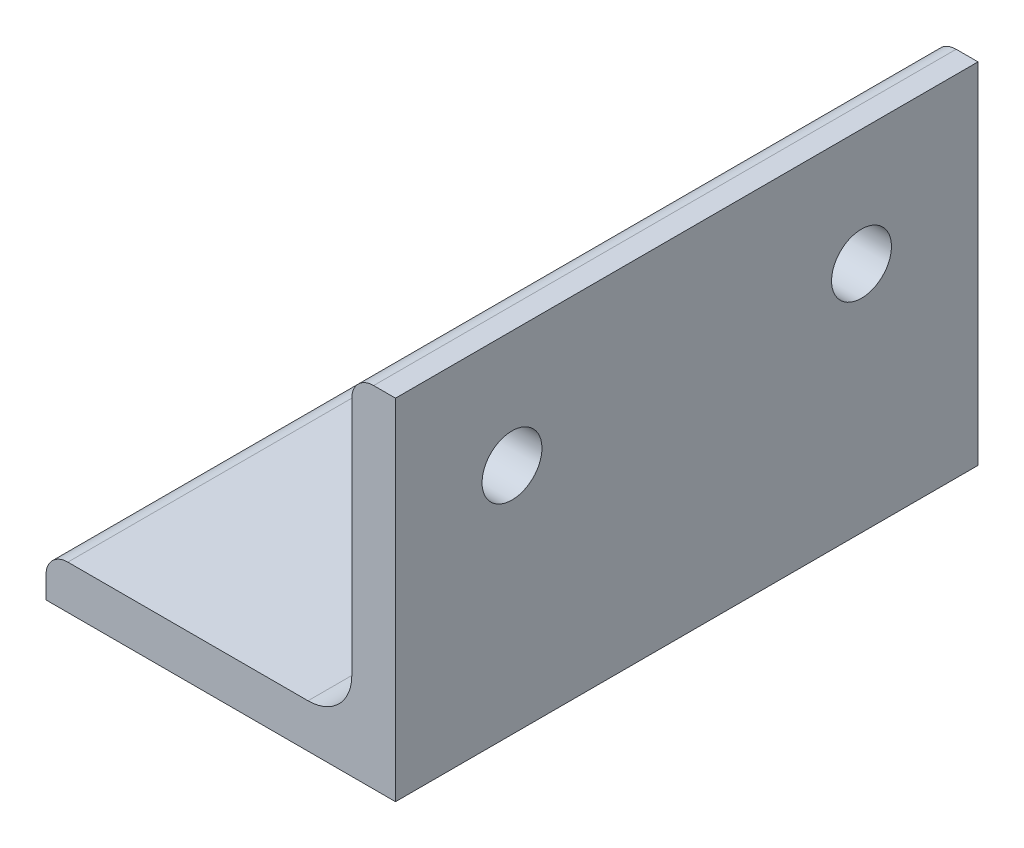
ISO-10303-21;
HEADER;
FILE_DESCRIPTION(('STEP AP214'),'2;1');
FILE_NAME('part.step','',(''),(''),'','','');
FILE_SCHEMA(('AUTOMOTIVE_DESIGN { 1 0 10303 214 1 1 1 1 }'));
ENDSEC;
DATA;
#1=APPLICATION_CONTEXT('core data for automotive mechanical design processes');
#2=APPLICATION_PROTOCOL_DEFINITION('international standard','automotive_design',2000,#1);
#3=PRODUCT_CONTEXT('',#1,'mechanical');
#4=PRODUCT('Part','Part','',(#3));
#5=PRODUCT_RELATED_PRODUCT_CATEGORY('part','',(#4));
#6=PRODUCT_DEFINITION_FORMATION('','',#4);
#7=PRODUCT_DEFINITION_CONTEXT('part definition',#1,'design');
#8=PRODUCT_DEFINITION('design','',#6,#7);
#9=PRODUCT_DEFINITION_SHAPE('','',#8);
#10=(LENGTH_UNIT() NAMED_UNIT(*) SI_UNIT(.MILLI.,.METRE.));
#11=(NAMED_UNIT(*) PLANE_ANGLE_UNIT() SI_UNIT($,.RADIAN.));
#12=(NAMED_UNIT(*) SI_UNIT($,.STERADIAN.) SOLID_ANGLE_UNIT());
#13=UNCERTAINTY_MEASURE_WITH_UNIT(LENGTH_MEASURE(1.E-05),#10,'distance_accuracy_value','');
#14=(GEOMETRIC_REPRESENTATION_CONTEXT(3) GLOBAL_UNCERTAINTY_ASSIGNED_CONTEXT((#13)) GLOBAL_UNIT_ASSIGNED_CONTEXT((#10,
#11,#12)) REPRESENTATION_CONTEXT('',''));
#15=CARTESIAN_POINT('',(0.,0.,0.));
#16=DIRECTION('',(0.,0.,1.));
#17=DIRECTION('',(1.,0.,0.));
#18=AXIS2_PLACEMENT_3D('',#15,#16,#17);
#19=CARTESIAN_POINT('',(-19.05,-16.66875,31.75));
#20=DIRECTION('',(1.,0.,0.));
#21=DIRECTION('',(0.,0.,-1.));
#22=AXIS2_PLACEMENT_3D('',#19,#20,#21);
#23=PLANE('',#22);
#24=DIRECTION('',(0.,-1.,0.));
#25=VECTOR('',#24,1.);
#26=CARTESIAN_POINT('',(-19.05,-16.66875,-31.75));
#27=LINE('',#26,#25);
#28=CARTESIAN_POINT('',(-19.05,-16.66875,-31.75));
#29=VERTEX_POINT('',#28);
#30=CARTESIAN_POINT('',(-19.05,-19.05,-31.75));
#31=VERTEX_POINT('',#30);
#32=EDGE_CURVE('E135',#29,#31,#27,.T.);
#33=ORIENTED_EDGE('',*,*,#32,.T.);
#34=DIRECTION('',(0.,0.,-1.));
#35=VECTOR('',#34,1.);
#36=CARTESIAN_POINT('',(-19.05,-19.05,31.75));
#37=LINE('',#36,#35);
#38=CARTESIAN_POINT('',(-19.05,-19.05,31.75));
#39=VERTEX_POINT('',#38);
#40=EDGE_CURVE('E11',#39,#31,#37,.T.);
#41=ORIENTED_EDGE('',*,*,#40,.F.);
#42=DIRECTION('',(0.,-1.,0.));
#43=VECTOR('',#42,1.);
#44=CARTESIAN_POINT('',(-19.05,-16.66875,31.75));
#45=LINE('',#44,#43);
#46=CARTESIAN_POINT('',(-19.05,-16.66875,31.75));
#47=VERTEX_POINT('',#46);
#48=EDGE_CURVE('E152',#47,#39,#45,.T.);
#49=ORIENTED_EDGE('',*,*,#48,.F.);
#50=DIRECTION('',(0.,0.,-1.));
#51=VECTOR('',#50,1.);
#52=CARTESIAN_POINT('',(-19.05,-16.66875,31.75));
#53=LINE('',#52,#51);
#54=EDGE_CURVE('E131',#47,#29,#53,.T.);
#55=ORIENTED_EDGE('',*,*,#54,.T.);
#56=EDGE_LOOP('',(#33,#41,#49,#55));
#57=FACE_BOUND('',#56,.T.);
#58=ADVANCED_FACE('F33',(#57),#23,.F.);
#59=CARTESIAN_POINT('',(-19.05,-19.05,31.75));
#60=DIRECTION('',(0.,1.,0.));
#61=DIRECTION('',(-1.,0.,0.));
#62=AXIS2_PLACEMENT_3D('',#59,#60,#61);
#63=PLANE('',#62);
#64=DIRECTION('',(1.,0.,0.));
#65=VECTOR('',#64,1.);
#66=CARTESIAN_POINT('',(-19.05,-19.05,-31.75));
#67=LINE('',#66,#65);
#68=CARTESIAN_POINT('',(19.05,-19.05,-31.75));
#69=VERTEX_POINT('',#68);
#70=EDGE_CURVE('E138',#31,#69,#67,.T.);
#71=ORIENTED_EDGE('',*,*,#70,.T.);
#72=DIRECTION('',(0.,0.,-1.));
#73=VECTOR('',#72,1.);
#74=CARTESIAN_POINT('',(19.05,-19.05,31.75));
#75=LINE('',#74,#73);
#76=CARTESIAN_POINT('',(19.05,-19.05,31.75));
#77=VERTEX_POINT('',#76);
#78=EDGE_CURVE('E41',#77,#69,#75,.T.);
#79=ORIENTED_EDGE('',*,*,#78,.F.);
#80=DIRECTION('',(1.,0.,0.));
#81=VECTOR('',#80,1.);
#82=CARTESIAN_POINT('',(-19.05,-19.05,31.75));
#83=LINE('',#82,#81);
#84=EDGE_CURVE('E95',#39,#77,#83,.T.);
#85=ORIENTED_EDGE('',*,*,#84,.F.);
#86=ORIENTED_EDGE('',*,*,#40,.T.);
#87=EDGE_LOOP('',(#71,#79,#85,#86));
#88=FACE_BOUND('',#87,.T.);
#89=ADVANCED_FACE('F228',(#88),#63,.F.);
#90=CARTESIAN_POINT('',(19.05,-19.05,31.75));
#91=DIRECTION('',(-1.,0.,0.));
#92=DIRECTION('',(0.,-1.,0.));
#93=AXIS2_PLACEMENT_3D('',#90,#91,#92);
#94=PLANE('',#93);
#95=CARTESIAN_POINT('',(19.05,6.34999999999988,-19.0500000000013));
#96=DIRECTION('',(-1.,0.,0.));
#97=DIRECTION('',(0.,-1.,0.));
#98=AXIS2_PLACEMENT_3D('',#95,#96,#97);
#99=CIRCLE('',#98,3.2639);
#100=CARTESIAN_POINT('',(19.05,3.08609999999987,-19.0500000000013));
#101=VERTEX_POINT('',#100);
#102=EDGE_CURVE('E139',#101,#101,#99,.F.);
#103=ORIENTED_EDGE('',*,*,#102,.F.);
#104=EDGE_LOOP('',(#103));
#105=FACE_BOUND('',#104,.T.);
#106=CARTESIAN_POINT('',(19.05,6.35000000000014,19.0499999999987));
#107=DIRECTION('',(-1.,0.,0.));
#108=DIRECTION('',(0.,-1.,0.));
#109=AXIS2_PLACEMENT_3D('',#106,#107,#108);
#110=CIRCLE('',#109,3.2639);
#111=CARTESIAN_POINT('',(19.05,3.08610000000014,19.0499999999987));
#112=VERTEX_POINT('',#111);
#113=EDGE_CURVE('E193',#112,#112,#110,.F.);
#114=ORIENTED_EDGE('',*,*,#113,.F.);
#115=EDGE_LOOP('',(#114));
#116=FACE_BOUND('',#115,.T.);
#117=DIRECTION('',(0.,1.,0.));
#118=VECTOR('',#117,1.);
#119=CARTESIAN_POINT('',(19.05,-19.05,-31.75));
#120=LINE('',#119,#118);
#121=CARTESIAN_POINT('',(19.05,19.05,-31.75));
#122=VERTEX_POINT('',#121);
#123=EDGE_CURVE('E141',#69,#122,#120,.T.);
#124=ORIENTED_EDGE('',*,*,#123,.T.);
#125=DIRECTION('',(0.,0.,-1.));
#126=VECTOR('',#125,1.);
#127=CARTESIAN_POINT('',(19.05,19.05,31.75));
#128=LINE('',#127,#126);
#129=CARTESIAN_POINT('',(19.05,19.05,31.75));
#130=VERTEX_POINT('',#129);
#131=EDGE_CURVE('E162',#130,#122,#128,.T.);
#132=ORIENTED_EDGE('',*,*,#131,.F.);
#133=DIRECTION('',(0.,1.,0.));
#134=VECTOR('',#133,1.);
#135=CARTESIAN_POINT('',(19.05,-19.05,31.75));
#136=LINE('',#135,#134);
#137=EDGE_CURVE('E170',#77,#130,#136,.T.);
#138=ORIENTED_EDGE('',*,*,#137,.F.);
#139=ORIENTED_EDGE('',*,*,#78,.T.);
#140=EDGE_LOOP('',(#124,#132,#138,#139));
#141=FACE_BOUND('',#140,.T.);
#142=ADVANCED_FACE('F168',(#105,#116,#141),#94,.F.);
#143=CARTESIAN_POINT('',(16.66875,19.05,31.75));
#144=DIRECTION('',(0.,-1.,0.));
#145=DIRECTION('',(1.,0.,0.));
#146=AXIS2_PLACEMENT_3D('',#143,#144,#145);
#147=PLANE('',#146);
#148=DIRECTION('',(-1.,0.,0.));
#149=VECTOR('',#148,1.);
#150=CARTESIAN_POINT('',(16.66875,19.05,-31.75));
#151=LINE('',#150,#149);
#152=CARTESIAN_POINT('',(16.66875,19.05,-31.75));
#153=VERTEX_POINT('',#152);
#154=EDGE_CURVE('E143',#122,#153,#151,.T.);
#155=ORIENTED_EDGE('',*,*,#154,.T.);
#156=DIRECTION('',(0.,0.,-1.));
#157=VECTOR('',#156,1.);
#158=CARTESIAN_POINT('',(16.66875,19.05,31.75));
#159=LINE('',#158,#157);
#160=CARTESIAN_POINT('',(16.66875,19.05,31.75));
#161=VERTEX_POINT('',#160);
#162=EDGE_CURVE('E159',#161,#153,#159,.T.);
#163=ORIENTED_EDGE('',*,*,#162,.F.);
#164=DIRECTION('',(-1.,0.,0.));
#165=VECTOR('',#164,1.);
#166=CARTESIAN_POINT('',(16.66875,19.05,31.75));
#167=LINE('',#166,#165);
#168=EDGE_CURVE('E186',#130,#161,#167,.T.);
#169=ORIENTED_EDGE('',*,*,#168,.F.);
#170=ORIENTED_EDGE('',*,*,#131,.T.);
#171=EDGE_LOOP('',(#155,#163,#169,#170));
#172=FACE_BOUND('',#171,.T.);
#173=ADVANCED_FACE('F179',(#172),#147,.F.);
#174=CARTESIAN_POINT('',(16.66875,16.66875,31.75));
#175=DIRECTION('',(0.,0.,-1.));
#176=DIRECTION('',(-1.,0.,0.));
#177=AXIS2_PLACEMENT_3D('',#174,#175,#176);
#178=CYLINDRICAL_SURFACE('',#177,2.38125);
#179=CARTESIAN_POINT('',(16.66875,16.66875,-31.75));
#180=DIRECTION('',(0.,0.,1.));
#181=DIRECTION('',(-1.,0.,0.));
#182=AXIS2_PLACEMENT_3D('',#179,#180,#181);
#183=CIRCLE('',#182,2.38125);
#184=CARTESIAN_POINT('',(14.2875,16.66875,-31.75));
#185=VERTEX_POINT('',#184);
#186=EDGE_CURVE('E145',#153,#185,#183,.T.);
#187=ORIENTED_EDGE('',*,*,#186,.T.);
#188=DIRECTION('',(0.,0.,-1.));
#189=VECTOR('',#188,1.);
#190=CARTESIAN_POINT('',(14.2875,16.66875,31.75));
#191=LINE('',#190,#189);
#192=CARTESIAN_POINT('',(14.2875,16.66875,31.75));
#193=VERTEX_POINT('',#192);
#194=EDGE_CURVE('E156',#193,#185,#191,.T.);
#195=ORIENTED_EDGE('',*,*,#194,.F.);
#196=CARTESIAN_POINT('',(16.66875,16.66875,31.75));
#197=DIRECTION('',(0.,0.,1.));
#198=DIRECTION('',(-1.,0.,0.));
#199=AXIS2_PLACEMENT_3D('',#196,#197,#198);
#200=CIRCLE('',#199,2.38125);
#201=EDGE_CURVE('E185',#161,#193,#200,.T.);
#202=ORIENTED_EDGE('',*,*,#201,.F.);
#203=ORIENTED_EDGE('',*,*,#162,.T.);
#204=EDGE_LOOP('',(#187,#195,#202,#203));
#205=FACE_BOUND('',#204,.T.);
#206=ADVANCED_FACE('F183',(#205),#178,.T.);
#207=CARTESIAN_POINT('',(14.2875,16.66875,31.75));
#208=DIRECTION('',(1.,0.,0.));
#209=DIRECTION('',(0.,1.,0.));
#210=AXIS2_PLACEMENT_3D('',#207,#208,#209);
#211=PLANE('',#210);
#212=CARTESIAN_POINT('',(14.2875,6.34999999999988,-19.0500000000013));
#213=DIRECTION('',(-1.,0.,0.));
#214=DIRECTION('',(0.,-1.,0.));
#215=AXIS2_PLACEMENT_3D('',#212,#213,#214);
#216=CIRCLE('',#215,3.2639);
#217=CARTESIAN_POINT('',(14.2875,3.08609999999987,-19.0500000000013));
#218=VERTEX_POINT('',#217);
#219=EDGE_CURVE('E196',#218,#218,#216,.T.);
#220=ORIENTED_EDGE('',*,*,#219,.F.);
#221=EDGE_LOOP('',(#220));
#222=FACE_BOUND('',#221,.T.);
#223=CARTESIAN_POINT('',(14.2875,6.35000000000014,19.0499999999987));
#224=DIRECTION('',(-1.,0.,0.));
#225=DIRECTION('',(0.,-1.,0.));
#226=AXIS2_PLACEMENT_3D('',#223,#224,#225);
#227=CIRCLE('',#226,3.2639);
#228=CARTESIAN_POINT('',(14.2875,3.08610000000014,19.0499999999987));
#229=VERTEX_POINT('',#228);
#230=EDGE_CURVE('E197',#229,#229,#227,.T.);
#231=ORIENTED_EDGE('',*,*,#230,.F.);
#232=EDGE_LOOP('',(#231));
#233=FACE_BOUND('',#232,.T.);
#234=DIRECTION('',(0.,-1.,0.));
#235=VECTOR('',#234,1.);
#236=CARTESIAN_POINT('',(14.2875,16.66875,-31.75));
#237=LINE('',#236,#235);
#238=CARTESIAN_POINT('',(14.2875,-9.5123,-31.75));
#239=VERTEX_POINT('',#238);
#240=EDGE_CURVE('E147',#185,#239,#237,.T.);
#241=ORIENTED_EDGE('',*,*,#240,.T.);
#242=DIRECTION('',(0.,0.,-1.));
#243=VECTOR('',#242,1.);
#244=CARTESIAN_POINT('',(14.2875,-9.5123,31.75));
#245=LINE('',#244,#243);
#246=CARTESIAN_POINT('',(14.2875,-9.5123,31.75));
#247=VERTEX_POINT('',#246);
#248=EDGE_CURVE('E126',#247,#239,#245,.T.);
#249=ORIENTED_EDGE('',*,*,#248,.F.);
#250=DIRECTION('',(0.,-1.,0.));
#251=VECTOR('',#250,1.);
#252=CARTESIAN_POINT('',(14.2875,16.66875,31.75));
#253=LINE('',#252,#251);
#254=EDGE_CURVE('E117',#193,#247,#253,.T.);
#255=ORIENTED_EDGE('',*,*,#254,.F.);
#256=ORIENTED_EDGE('',*,*,#194,.T.);
#257=EDGE_LOOP('',(#241,#249,#255,#256));
#258=FACE_BOUND('',#257,.T.);
#259=ADVANCED_FACE('F208',(#222,#233,#258),#211,.F.);
#260=CARTESIAN_POINT('',(9.51230000000001,-9.5123,31.75));
#261=DIRECTION('',(0.,0.,-1.));
#262=DIRECTION('',(-1.,0.,0.));
#263=AXIS2_PLACEMENT_3D('',#260,#261,#262);
#264=CYLINDRICAL_SURFACE('',#263,4.7752);
#265=CARTESIAN_POINT('',(9.51230000000001,-9.5123,-31.75));
#266=DIRECTION('',(0.,0.,-1.));
#267=DIRECTION('',(-1.,0.,0.));
#268=AXIS2_PLACEMENT_3D('',#265,#266,#267);
#269=CIRCLE('',#268,4.7752);
#270=CARTESIAN_POINT('',(9.51230000000001,-14.2875,-31.75));
#271=VERTEX_POINT('',#270);
#272=EDGE_CURVE('E125',#239,#271,#269,.T.);
#273=ORIENTED_EDGE('',*,*,#272,.T.);
#274=DIRECTION('',(0.,0.,-1.));
#275=VECTOR('',#274,1.);
#276=CARTESIAN_POINT('',(9.51230000000001,-14.2875,31.75));
#277=LINE('',#276,#275);
#278=CARTESIAN_POINT('',(9.51230000000001,-14.2875,31.75));
#279=VERTEX_POINT('',#278);
#280=EDGE_CURVE('E122',#279,#271,#277,.T.);
#281=ORIENTED_EDGE('',*,*,#280,.F.);
#282=CARTESIAN_POINT('',(9.51230000000001,-9.5123,31.75));
#283=DIRECTION('',(0.,0.,-1.));
#284=DIRECTION('',(-1.,0.,0.));
#285=AXIS2_PLACEMENT_3D('',#282,#283,#284);
#286=CIRCLE('',#285,4.7752);
#287=EDGE_CURVE('E111',#247,#279,#286,.T.);
#288=ORIENTED_EDGE('',*,*,#287,.F.);
#289=ORIENTED_EDGE('',*,*,#248,.T.);
#290=EDGE_LOOP('',(#273,#281,#288,#289));
#291=FACE_BOUND('',#290,.T.);
#292=ADVANCED_FACE('F123',(#291),#264,.F.);
#293=CARTESIAN_POINT('',(9.51230000000001,-14.2875,31.75));
#294=DIRECTION('',(0.,-1.,0.));
#295=DIRECTION('',(0.,0.,-1.));
#296=AXIS2_PLACEMENT_3D('',#293,#294,#295);
#297=PLANE('',#296);
#298=DIRECTION('',(-1.,0.,0.));
#299=VECTOR('',#298,1.);
#300=CARTESIAN_POINT('',(9.51230000000001,-14.2875,-31.75));
#301=LINE('',#300,#299);
#302=CARTESIAN_POINT('',(-16.66875,-14.2875,-31.75));
#303=VERTEX_POINT('',#302);
#304=EDGE_CURVE('E81',#271,#303,#301,.T.);
#305=ORIENTED_EDGE('',*,*,#304,.T.);
#306=DIRECTION('',(0.,0.,-1.));
#307=VECTOR('',#306,1.);
#308=CARTESIAN_POINT('',(-16.66875,-14.2875,31.75));
#309=LINE('',#308,#307);
#310=CARTESIAN_POINT('',(-16.66875,-14.2875,31.75));
#311=VERTEX_POINT('',#310);
#312=EDGE_CURVE('E127',#311,#303,#309,.T.);
#313=ORIENTED_EDGE('',*,*,#312,.F.);
#314=DIRECTION('',(-1.,0.,0.));
#315=VECTOR('',#314,1.);
#316=CARTESIAN_POINT('',(9.51230000000001,-14.2875,31.75));
#317=LINE('',#316,#315);
#318=EDGE_CURVE('E115',#279,#311,#317,.T.);
#319=ORIENTED_EDGE('',*,*,#318,.F.);
#320=ORIENTED_EDGE('',*,*,#280,.T.);
#321=EDGE_LOOP('',(#305,#313,#319,#320));
#322=FACE_BOUND('',#321,.T.);
#323=ADVANCED_FACE('F129',(#322),#297,.F.);
#324=CARTESIAN_POINT('',(-16.66875,-16.66875,31.75));
#325=DIRECTION('',(0.,0.,-1.));
#326=DIRECTION('',(-1.,0.,0.));
#327=AXIS2_PLACEMENT_3D('',#324,#325,#326);
#328=CYLINDRICAL_SURFACE('',#327,2.38125);
#329=CARTESIAN_POINT('',(-16.66875,-16.66875,-31.75));
#330=DIRECTION('',(0.,0.,1.));
#331=DIRECTION('',(-1.,0.,0.));
#332=AXIS2_PLACEMENT_3D('',#329,#330,#331);
#333=CIRCLE('',#332,2.38125);
#334=EDGE_CURVE('E87',#303,#29,#333,.T.);
#335=ORIENTED_EDGE('',*,*,#334,.T.);
#336=ORIENTED_EDGE('',*,*,#54,.F.);
#337=CARTESIAN_POINT('',(-16.66875,-16.66875,31.75));
#338=DIRECTION('',(0.,0.,1.));
#339=DIRECTION('',(-1.,0.,0.));
#340=AXIS2_PLACEMENT_3D('',#337,#338,#339);
#341=CIRCLE('',#340,2.38125);
#342=EDGE_CURVE('E49',#311,#47,#341,.T.);
#343=ORIENTED_EDGE('',*,*,#342,.F.);
#344=ORIENTED_EDGE('',*,*,#312,.T.);
#345=EDGE_LOOP('',(#335,#336,#343,#344));
#346=FACE_BOUND('',#345,.T.);
#347=ADVANCED_FACE('F217',(#346),#328,.T.);
#348=CARTESIAN_POINT('',(16.66875,16.66875,31.75));
#349=DIRECTION('',(0.,0.,-1.));
#350=DIRECTION('',(-1.,0.,0.));
#351=AXIS2_PLACEMENT_3D('',#348,#349,#350);
#352=PLANE('',#351);
#353=ORIENTED_EDGE('',*,*,#48,.T.);
#354=ORIENTED_EDGE('',*,*,#84,.T.);
#355=ORIENTED_EDGE('',*,*,#137,.T.);
#356=ORIENTED_EDGE('',*,*,#168,.T.);
#357=ORIENTED_EDGE('',*,*,#201,.T.);
#358=ORIENTED_EDGE('',*,*,#254,.T.);
#359=ORIENTED_EDGE('',*,*,#287,.T.);
#360=ORIENTED_EDGE('',*,*,#318,.T.);
#361=ORIENTED_EDGE('',*,*,#342,.T.);
#362=EDGE_LOOP('',(#353,#354,#355,#356,#357,#358,#359,#360,#361));
#363=FACE_BOUND('',#362,.T.);
#364=ADVANCED_FACE('F113',(#363),#352,.F.);
#365=CARTESIAN_POINT('',(16.66875,16.66875,-31.75));
#366=DIRECTION('',(0.,0.,-1.));
#367=DIRECTION('',(-1.,0.,0.));
#368=AXIS2_PLACEMENT_3D('',#365,#366,#367);
#369=PLANE('',#368);
#370=ORIENTED_EDGE('',*,*,#32,.F.);
#371=ORIENTED_EDGE('',*,*,#334,.F.);
#372=ORIENTED_EDGE('',*,*,#304,.F.);
#373=ORIENTED_EDGE('',*,*,#272,.F.);
#374=ORIENTED_EDGE('',*,*,#240,.F.);
#375=ORIENTED_EDGE('',*,*,#186,.F.);
#376=ORIENTED_EDGE('',*,*,#154,.F.);
#377=ORIENTED_EDGE('',*,*,#123,.F.);
#378=ORIENTED_EDGE('',*,*,#70,.F.);
#379=EDGE_LOOP('',(#370,#371,#372,#373,#374,#375,#376,#377,#378));
#380=FACE_BOUND('',#379,.T.);
#381=ADVANCED_FACE('F174',(#380),#369,.T.);
#382=CARTESIAN_POINT('',(19.051,6.35000000000014,19.0499999999987));
#383=DIRECTION('',(-1.,0.,0.));
#384=DIRECTION('',(0.,-1.,0.));
#385=AXIS2_PLACEMENT_3D('',#382,#383,#384);
#386=CYLINDRICAL_SURFACE('',#385,3.2639);
#387=ORIENTED_EDGE('',*,*,#230,.T.);
#388=EDGE_LOOP('',(#387));
#389=FACE_BOUND('',#388,.T.);
#390=ORIENTED_EDGE('',*,*,#113,.T.);
#391=EDGE_LOOP('',(#390));
#392=FACE_BOUND('',#391,.T.);
#393=ADVANCED_FACE('F272',(#389,#392),#386,.F.);
#394=CARTESIAN_POINT('',(19.051,6.34999999999988,-19.0500000000013));
#395=DIRECTION('',(-1.,0.,0.));
#396=DIRECTION('',(0.,-1.,0.));
#397=AXIS2_PLACEMENT_3D('',#394,#395,#396);
#398=CYLINDRICAL_SURFACE('',#397,3.2639);
#399=ORIENTED_EDGE('',*,*,#219,.T.);
#400=EDGE_LOOP('',(#399));
#401=FACE_BOUND('',#400,.T.);
#402=ORIENTED_EDGE('',*,*,#102,.T.);
#403=EDGE_LOOP('',(#402));
#404=FACE_BOUND('',#403,.T.);
#405=ADVANCED_FACE('F205',(#401,#404),#398,.F.);
#406=CLOSED_SHELL('',(#58,#89,#142,#173,#206,#259,#292,#323,#347,#364,#381,#393,#405));
#407=MANIFOLD_SOLID_BREP('B2',#406);
#408=ADVANCED_BREP_SHAPE_REPRESENTATION('',(#18,#407),#14);
#409=SHAPE_DEFINITION_REPRESENTATION(#9,#408);
ENDSEC;
END-ISO-10303-21;
